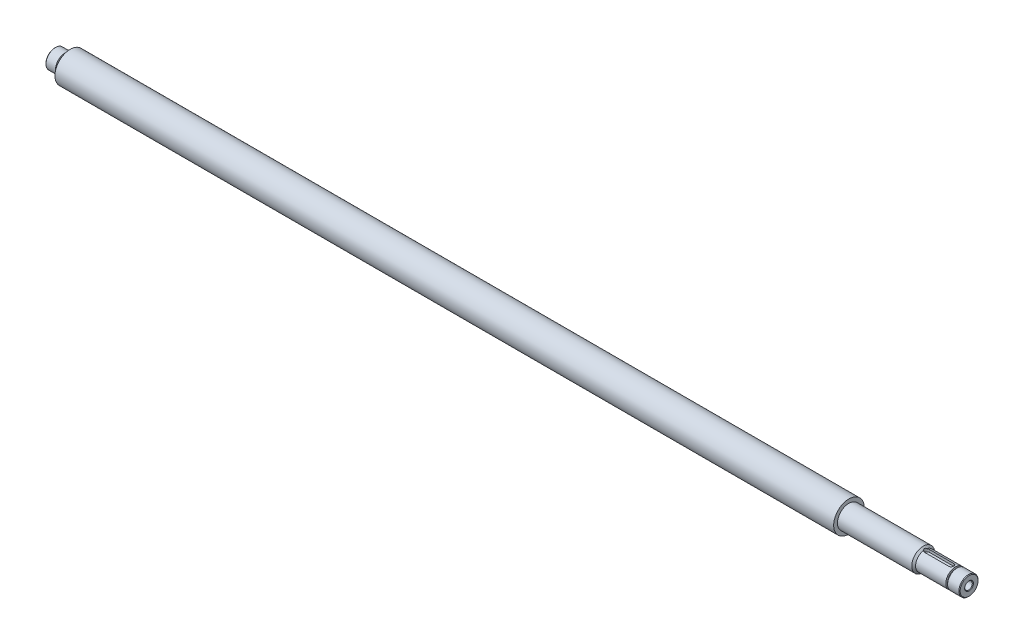
ISO-10303-21;
HEADER;
FILE_DESCRIPTION(('STEP AP214'),'2;1');
FILE_NAME('part.step','',(''),(''),'','','');
FILE_SCHEMA(('AUTOMOTIVE_DESIGN { 1 0 10303 214 1 1 1 1 }'));
ENDSEC;
DATA;
#1=APPLICATION_CONTEXT('core data for automotive mechanical design processes');
#2=APPLICATION_PROTOCOL_DEFINITION('international standard','automotive_design',2000,#1);
#3=PRODUCT_CONTEXT('',#1,'mechanical');
#4=PRODUCT('Part','Part','',(#3));
#5=PRODUCT_RELATED_PRODUCT_CATEGORY('part','',(#4));
#6=PRODUCT_DEFINITION_FORMATION('','',#4);
#7=PRODUCT_DEFINITION_CONTEXT('part definition',#1,'design');
#8=PRODUCT_DEFINITION('design','',#6,#7);
#9=PRODUCT_DEFINITION_SHAPE('','',#8);
#10=(LENGTH_UNIT() NAMED_UNIT(*) SI_UNIT(.MILLI.,.METRE.));
#11=(NAMED_UNIT(*) PLANE_ANGLE_UNIT() SI_UNIT($,.RADIAN.));
#12=(NAMED_UNIT(*) SI_UNIT($,.STERADIAN.) SOLID_ANGLE_UNIT());
#13=UNCERTAINTY_MEASURE_WITH_UNIT(LENGTH_MEASURE(1.E-05),#10,'distance_accuracy_value','');
#14=(GEOMETRIC_REPRESENTATION_CONTEXT(3) GLOBAL_UNCERTAINTY_ASSIGNED_CONTEXT((#13)) GLOBAL_UNIT_ASSIGNED_CONTEXT((#10,
#11,#12)) REPRESENTATION_CONTEXT('',''));
#15=CARTESIAN_POINT('',(0.,0.,0.));
#16=DIRECTION('',(0.,0.,1.));
#17=DIRECTION('',(1.,0.,0.));
#18=AXIS2_PLACEMENT_3D('',#15,#16,#17);
#19=CARTESIAN_POINT('',(364.29314999998,0.,0.));
#20=DIRECTION('',(1.,0.,0.));
#21=DIRECTION('',(0.,0.,-1.));
#22=AXIS2_PLACEMENT_3D('',#19,#20,#21);
#23=PLANE('',#22);
#24=CARTESIAN_POINT('',(364.29314999998,0.,0.));
#25=DIRECTION('',(1.,0.,0.));
#26=DIRECTION('',(0.,0.,-1.));
#27=AXIS2_PLACEMENT_3D('',#24,#25,#26);
#28=CIRCLE('',#27,1.5875);
#29=CARTESIAN_POINT('',(364.29314999998,0.,-1.5875));
#30=VERTEX_POINT('',#29);
#31=EDGE_CURVE('E19',#30,#30,#28,.T.);
#32=ORIENTED_EDGE('',*,*,#31,.T.);
#33=EDGE_LOOP('',(#32));
#34=FACE_BOUND('',#33,.T.);
#35=ADVANCED_FACE('F16',(#34),#23,.T.);
#36=CARTESIAN_POINT('',(364.29314999998,0.,0.));
#37=DIRECTION('',(1.,0.,0.));
#38=DIRECTION('',(0.,0.,-1.));
#39=AXIS2_PLACEMENT_3D('',#36,#37,#38);
#40=CYLINDRICAL_SURFACE('',#39,1.5875);
#41=ORIENTED_EDGE('',*,*,#31,.F.);
#42=EDGE_LOOP('',(#41));
#43=FACE_BOUND('',#42,.T.);
#44=CARTESIAN_POINT('',(383.089149999989,0.,0.));
#45=DIRECTION('',(1.,0.,0.));
#46=DIRECTION('',(0.,0.,-1.));
#47=AXIS2_PLACEMENT_3D('',#44,#45,#46);
#48=CIRCLE('',#47,1.58750000002783);
#49=CARTESIAN_POINT('',(383.089149999989,0.,-1.58750000002783));
#50=VERTEX_POINT('',#49);
#51=EDGE_CURVE('E108',#50,#50,#48,.T.);
#52=ORIENTED_EDGE('',*,*,#51,.T.);
#53=EDGE_LOOP('',(#52));
#54=FACE_BOUND('',#53,.T.);
#55=ADVANCED_FACE('F196',(#43,#54),#40,.F.);
#56=CARTESIAN_POINT('',(383.343149999916,0.,0.));
#57=DIRECTION('',(1.,0.,0.));
#58=DIRECTION('',(0.,1.,0.));
#59=AXIS2_PLACEMENT_3D('',#56,#57,#58);
#60=CONICAL_SURFACE('',#59,1.84149999989813,0.785398163397448);
#61=ORIENTED_EDGE('',*,*,#51,.F.);
#62=EDGE_LOOP('',(#61));
#63=FACE_BOUND('',#62,.T.);
#64=CARTESIAN_POINT('',(383.343149999973,0.,0.));
#65=DIRECTION('',(1.,0.,0.));
#66=DIRECTION('',(0.,1.,0.));
#67=AXIS2_PLACEMENT_3D('',#64,#65,#66);
#68=CIRCLE('',#67,1.84149999995498);
#69=CARTESIAN_POINT('',(383.343149999973,1.84149999995498,0.));
#70=VERTEX_POINT('',#69);
#71=EDGE_CURVE('E110',#70,#70,#68,.F.);
#72=ORIENTED_EDGE('',*,*,#71,.F.);
#73=EDGE_LOOP('',(#72));
#74=FACE_BOUND('',#73,.T.);
#75=ADVANCED_FACE('F193',(#63,#74),#60,.F.);
#76=CARTESIAN_POINT('',(383.34314999998,0.,0.));
#77=DIRECTION('',(1.,0.,0.));
#78=DIRECTION('',(0.,0.,-1.));
#79=AXIS2_PLACEMENT_3D('',#76,#77,#78);
#80=PLANE('',#79);
#81=CARTESIAN_POINT('',(383.343149999973,0.,0.));
#82=DIRECTION('',(-1.,0.,0.));
#83=DIRECTION('',(0.,0.,1.));
#84=AXIS2_PLACEMENT_3D('',#81,#82,#83);
#85=CIRCLE('',#84,3.71474999991506);
#86=CARTESIAN_POINT('',(383.343149999973,0.,3.71474999991506));
#87=VERTEX_POINT('',#86);
#88=EDGE_CURVE('E107',#87,#87,#85,.T.);
#89=ORIENTED_EDGE('',*,*,#88,.F.);
#90=EDGE_LOOP('',(#89));
#91=FACE_BOUND('',#90,.T.);
#92=ORIENTED_EDGE('',*,*,#71,.T.);
#93=EDGE_LOOP('',(#92));
#94=FACE_BOUND('',#93,.T.);
#95=ADVANCED_FACE('F189',(#91,#94),#80,.T.);
#96=CARTESIAN_POINT('',(383.089149999989,0.,0.));
#97=DIRECTION('',(-1.,0.,0.));
#98=DIRECTION('',(0.,0.,1.));
#99=AXIS2_PLACEMENT_3D('',#96,#97,#98);
#100=CONICAL_SURFACE('',#99,3.96874999989905,0.785398163397448);
#101=ORIENTED_EDGE('',*,*,#88,.T.);
#102=EDGE_LOOP('',(#101));
#103=FACE_BOUND('',#102,.T.);
#104=CARTESIAN_POINT('',(383.08914999998,0.,0.));
#105=DIRECTION('',(-1.,0.,0.));
#106=DIRECTION('',(0.,0.,1.));
#107=AXIS2_PLACEMENT_3D('',#104,#105,#106);
#108=CIRCLE('',#107,3.96875);
#109=CARTESIAN_POINT('',(383.08914999998,0.,3.96875));
#110=VERTEX_POINT('',#109);
#111=EDGE_CURVE('E103',#110,#110,#108,.T.);
#112=ORIENTED_EDGE('',*,*,#111,.F.);
#113=EDGE_LOOP('',(#112));
#114=FACE_BOUND('',#113,.T.);
#115=ADVANCED_FACE('F185',(#103,#114),#100,.T.);
#116=CARTESIAN_POINT('',(3.175,0.,0.));
#117=DIRECTION('',(-1.,0.,0.));
#118=DIRECTION('',(0.,0.,1.));
#119=AXIS2_PLACEMENT_3D('',#116,#117,#118);
#120=PLANE('',#119);
#121=CARTESIAN_POINT('',(3.17500000005566,0.,0.));
#122=DIRECTION('',(1.,0.,0.));
#123=DIRECTION('',(0.,0.,-1.));
#124=AXIS2_PLACEMENT_3D('',#121,#122,#123);
#125=CIRCLE('',#124,3.7147499999719);
#126=CARTESIAN_POINT('',(3.17500000005566,0.,-3.7147499999719));
#127=VERTEX_POINT('',#126);
#128=EDGE_CURVE('E106',#127,#127,#125,.T.);
#129=ORIENTED_EDGE('',*,*,#128,.F.);
#130=EDGE_LOOP('',(#129));
#131=FACE_BOUND('',#130,.T.);
#132=ADVANCED_FACE('F181',(#131),#120,.T.);
#133=CARTESIAN_POINT('',(383.34314999998,0.,0.));
#134=DIRECTION('',(-1.,0.,0.));
#135=DIRECTION('',(0.,0.,1.));
#136=AXIS2_PLACEMENT_3D('',#133,#134,#135);
#137=CYLINDRICAL_SURFACE('',#136,3.96875);
#138=ORIENTED_EDGE('',*,*,#111,.T.);
#139=EDGE_LOOP('',(#138));
#140=FACE_BOUND('',#139,.T.);
#141=CARTESIAN_POINT('',(378.36474999998,0.,0.));
#142=DIRECTION('',(-1.,0.,0.));
#143=DIRECTION('',(0.,0.,1.));
#144=AXIS2_PLACEMENT_3D('',#141,#142,#143);
#145=CIRCLE('',#144,3.96875);
#146=CARTESIAN_POINT('',(378.36474999998,0.,3.96875));
#147=VERTEX_POINT('',#146);
#148=EDGE_CURVE('E77',#147,#147,#145,.T.);
#149=ORIENTED_EDGE('',*,*,#148,.F.);
#150=EDGE_LOOP('',(#149));
#151=FACE_BOUND('',#150,.T.);
#152=ADVANCED_FACE('F177',(#140,#151),#137,.T.);
#153=CARTESIAN_POINT('',(3.42899999992596,0.,0.));
#154=DIRECTION('',(1.,0.,0.));
#155=DIRECTION('',(0.,0.,-1.));
#156=AXIS2_PLACEMENT_3D('',#153,#154,#155);
#157=CONICAL_SURFACE('',#156,3.96874999989905,0.785398163509345);
#158=ORIENTED_EDGE('',*,*,#128,.T.);
#159=EDGE_LOOP('',(#158));
#160=FACE_BOUND('',#159,.T.);
#161=CARTESIAN_POINT('',(3.42900000000003,0.,0.));
#162=DIRECTION('',(1.,0.,0.));
#163=DIRECTION('',(0.,0.,-1.));
#164=AXIS2_PLACEMENT_3D('',#161,#162,#163);
#165=CIRCLE('',#164,3.96875);
#166=CARTESIAN_POINT('',(3.42900000000003,0.,-3.96875));
#167=VERTEX_POINT('',#166);
#168=EDGE_CURVE('E99',#167,#167,#165,.T.);
#169=ORIENTED_EDGE('',*,*,#168,.F.);
#170=EDGE_LOOP('',(#169));
#171=FACE_BOUND('',#170,.T.);
#172=ADVANCED_FACE('F173',(#160,#171),#157,.T.);
#173=CARTESIAN_POINT('',(378.36474999998,0.,-22.225));
#174=DIRECTION('',(-1.,0.,0.));
#175=DIRECTION('',(0.,0.,1.));
#176=AXIS2_PLACEMENT_3D('',#173,#174,#175);
#177=PLANE('',#176);
#178=ORIENTED_EDGE('',*,*,#148,.T.);
#179=EDGE_LOOP('',(#178));
#180=FACE_BOUND('',#179,.T.);
#181=CARTESIAN_POINT('',(378.36474999998,0.,0.));
#182=DIRECTION('',(1.,0.,0.));
#183=DIRECTION('',(0.,0.,-1.));
#184=AXIS2_PLACEMENT_3D('',#181,#182,#183);
#185=CIRCLE('',#184,3.175);
#186=CARTESIAN_POINT('',(378.36474999998,0.,-3.175));
#187=VERTEX_POINT('',#186);
#188=EDGE_CURVE('E102',#187,#187,#185,.F.);
#189=ORIENTED_EDGE('',*,*,#188,.F.);
#190=EDGE_LOOP('',(#189));
#191=FACE_BOUND('',#190,.T.);
#192=ADVANCED_FACE('F167',(#180,#191),#177,.T.);
#193=CARTESIAN_POINT('',(365.81714999998,5.30554999999999,0.));
#194=DIRECTION('',(0.,-1.,0.));
#195=DIRECTION('',(0.,0.,-1.));
#196=AXIS2_PLACEMENT_3D('',#193,#194,#195);
#197=CYLINDRICAL_SURFACE('',#196,1.016);
#198=CARTESIAN_POINT('',(365.81714999998,3.83649847680146,1.01600000000003));
#199=CARTESIAN_POINT('',(365.789074339526,3.83649655807795,1.01600024098621));
#200=CARTESIAN_POINT('',(365.7610128192,3.83680706636788,1.01483546195629));
#201=CARTESIAN_POINT('',(365.705099410303,3.83803295663375,1.01019216098555));
#202=CARTESIAN_POINT('',(365.677247490381,3.83894824625515,1.00671399231573));
#203=CARTESIAN_POINT('',(365.594402662799,3.84256546981599,0.992856299490583));
#204=CARTESIAN_POINT('',(365.539979413233,3.84613895420594,0.979053401170294));
#205=CARTESIAN_POINT('',(365.434316289364,3.85519131533632,0.942773419508419));
#206=CARTESIAN_POINT('',(365.383076692287,3.86067035773495,0.920295581999039));
#207=CARTESIAN_POINT('',(365.285096296162,3.87291119616642,0.867334861884763));
#208=CARTESIAN_POINT('',(365.238352927547,3.87967225289173,0.836856589068619));
#209=CARTESIAN_POINT('',(365.169226267174,3.89074557233872,0.783245948925418));
#210=CARTESIAN_POINT('',(365.14492969341,3.89487805845011,0.76249275990274));
#211=CARTESIAN_POINT('',(365.09843710947,3.9031715311668,0.718833958468433));
#212=CARTESIAN_POINT('',(365.076237660529,3.9073324586808,0.695931996926632));
#213=CARTESIAN_POINT('',(365.055149999974,3.91144021589343,0.672020833004098));
#214=B_SPLINE_CURVE_WITH_KNOTS('',3,(#198,#199,#200,#201,#202,#203,#204,#205,#206,#207,#208,
#209,#210,#211,#212,#213),.UNSPECIFIED.,.F.,.F.,(4,2,2,2,2,2,2,4),(0.,0.084173300717206,
0.168333750525152,0.336236358766278,0.50415356714138,0.67197423449429,0.768506844657109,
0.864878312959558),.UNSPECIFIED.);
#215=CARTESIAN_POINT('',(365.81714999998,3.83649847680146,1.01600000000003));
#216=VERTEX_POINT('',#215);
#217=CARTESIAN_POINT('',(365.055149999982,3.91144021584078,0.672020833012472));
#218=VERTEX_POINT('',#217);
#219=EDGE_CURVE('E95',#216,#218,#214,.T.);
#220=ORIENTED_EDGE('',*,*,#219,.F.);
#221=DIRECTION('',(0.,-1.,0.));
#222=VECTOR('',#221,1.);
#223=CARTESIAN_POINT('',(365.81714999998,5.30554999999999,1.01600000000003));
#224=LINE('',#223,#222);
#225=CARTESIAN_POINT('',(365.81714999998,2.81634999999999,1.01600000000003));
#226=VERTEX_POINT('',#225);
#227=EDGE_CURVE('E93',#226,#216,#224,.F.);
#228=ORIENTED_EDGE('',*,*,#227,.F.);
#229=CARTESIAN_POINT('',(365.81714999998,2.81634999999999,0.));
#230=DIRECTION('',(0.,-1.,0.));
#231=DIRECTION('',(0.,0.,-1.));
#232=AXIS2_PLACEMENT_3D('',#229,#230,#231);
#233=CIRCLE('',#232,1.016);
#234=CARTESIAN_POINT('',(365.81714999998,2.81634999999999,-1.01599999999997));
#235=VERTEX_POINT('',#234);
#236=EDGE_CURVE('E91',#226,#235,#233,.T.);
#237=ORIENTED_EDGE('',*,*,#236,.T.);
#238=DIRECTION('',(0.,-1.,0.));
#239=VECTOR('',#238,1.);
#240=CARTESIAN_POINT('',(365.81714999998,5.30554999999999,-1.01599999999997));
#241=LINE('',#240,#239);
#242=CARTESIAN_POINT('',(365.81714999998,3.83649847680148,-1.01599999999997));
#243=VERTEX_POINT('',#242);
#244=EDGE_CURVE('E76',#243,#235,#241,.T.);
#245=ORIENTED_EDGE('',*,*,#244,.F.);
#246=CARTESIAN_POINT('',(365.05514999998,3.91144021589234,-0.672020833010454));
#247=CARTESIAN_POINT('',(365.092863201918,3.90408226838989,-0.714842817990914));
#248=CARTESIAN_POINT('',(365.134224918746,3.89655779756544,-0.754419427857203));
#249=CARTESIAN_POINT('',(365.223086497352,3.88197562196348,-0.826189348854452));
#250=CARTESIAN_POINT('',(365.270594355154,3.87491854366297,-0.858372887617566));
#251=CARTESIAN_POINT('',(365.37054734497,3.86208640953377,-0.914382203674269));
#252=CARTESIAN_POINT('',(365.422998681667,3.85631299621681,-0.938197295479835));
#253=CARTESIAN_POINT('',(365.531257868991,3.8467604993438,-0.976630360325471));
#254=CARTESIAN_POINT('',(365.587058548847,3.84297731334557,-0.991267264360344));
#255=CARTESIAN_POINT('',(365.672317957102,3.83912394272326,-1.00604532812612));
#256=CARTESIAN_POINT('',(365.701156173613,3.83814278398676,-1.0097754687014));
#257=CARTESIAN_POINT('',(365.75904132168,3.8368291335745,-1.01475220932442));
#258=CARTESIAN_POINT('',(365.78808810149,3.83649621045302,-1.01600046125276));
#259=CARTESIAN_POINT('',(365.81714999998,3.83649847680148,-1.01599999999997));
#260=B_SPLINE_CURVE_WITH_KNOTS('',3,(#246,#247,#248,#249,#250,#251,#252,#253,#254,#255,#256,
#257,#258,#259),.UNSPECIFIED.,.F.,.F.,(4,2,2,2,2,2,4),(0.,0.17240455398,0.345035702357616,
0.517886485481197,0.690379562391287,0.777564930764776,0.86469225137165),.UNSPECIFIED.);
#261=CARTESIAN_POINT('',(365.055149999968,3.91144021578482,-0.672020832996854));
#262=VERTEX_POINT('',#261);
#263=EDGE_CURVE('E66',#262,#243,#260,.T.);
#264=ORIENTED_EDGE('',*,*,#263,.F.);
#265=CARTESIAN_POINT('',(365.055149999937,3.91144021579326,0.672020832961947));
#266=CARTESIAN_POINT('',(365.026045649241,3.94663707757243,0.638985000088227));
#267=CARTESIAN_POINT('',(364.99813445496,3.98057362417654,0.603031915369367));
#268=CARTESIAN_POINT('',(364.945782346284,4.04446808087447,0.52463353926634));
#269=CARTESIAN_POINT('',(364.921387328837,4.07437308912116,0.482115200203082));
#270=CARTESIAN_POINT('',(364.88324642174,4.12126181441779,0.401911695213403));
#271=CARTESIAN_POINT('',(364.868355806798,4.13961619956198,0.365594566361844));
#272=CARTESIAN_POINT('',(364.842514459879,4.17151821849332,0.289723753061901));
#273=CARTESIAN_POINT('',(364.831548734036,4.18508414235761,0.25018310998333));
#274=CARTESIAN_POINT('',(364.814258213123,4.20649305464903,0.168050687431386));
#275=CARTESIAN_POINT('',(364.807988168618,4.21426852199973,0.125429079943492));
#276=CARTESIAN_POINT('',(364.800977206253,4.22296361722546,0.0390204895654291));
#277=CARTESIAN_POINT('',(364.800234806667,4.22388508236565,-0.00476617786333961));
#278=CARTESIAN_POINT('',(364.804035806214,4.21917025653282,-0.0849404597698114));
#279=CARTESIAN_POINT('',(364.807784476603,4.21451992539556,-0.121431098087903));
#280=CARTESIAN_POINT('',(364.818977695527,4.20064865423194,-0.192918818065849));
#281=CARTESIAN_POINT('',(364.826421938455,4.19142809214245,-0.227916022965843));
#282=CARTESIAN_POINT('',(364.847034893171,4.16593408534218,-0.305201192198014));
#283=CARTESIAN_POINT('',(364.861220946354,4.14841101056433,-0.346801535770036));
#284=CARTESIAN_POINT('',(364.893725643349,4.10836577713652,-0.425891694219275));
#285=CARTESIAN_POINT('',(364.912060244422,4.08582432097091,-0.463364783610832));
#286=CARTESIAN_POINT('',(364.950316407108,4.03894291029061,-0.53128121744061));
#287=CARTESIAN_POINT('',(364.97001172542,4.01486952292547,-0.562042296543696));
#288=CARTESIAN_POINT('',(365.011284433417,3.96459674581604,-0.619737119716292));
#289=CARTESIAN_POINT('',(365.032841403113,3.9384205992902,-0.646705536926426));
#290=CARTESIAN_POINT('',(365.055149999947,3.9114402157815,-0.672020832972935));
#291=B_SPLINE_CURVE_WITH_KNOTS('',3,(#265,#266,#267,#268,#269,#270,#271,#272,#273,#274,#275,
#276,#277,#278,#279,#280,#281,#282,#283,#284,#285,#286,#287,#288,#289,#290),.UNSPECIFIED.,.F.,
.F.,(4,2,2,2,2,2,2,2,2,2,2,2,4),(0.,0.169491291431036,0.34102606970601,0.470534814534422,
0.59954339215234,0.730033713382287,0.860489054471362,0.970897544435752,1.08129690565363,
1.22247535003477,1.364206353615,1.49517443421655,1.62485417002255),.UNSPECIFIED.);
#292=EDGE_CURVE('E60',#218,#262,#291,.T.);
#293=ORIENTED_EDGE('',*,*,#292,.F.);
#294=EDGE_LOOP('',(#220,#228,#237,#245,#264,#293));
#295=FACE_BOUND('',#294,.T.);
#296=ADVANCED_FACE('F89',(#295),#197,.F.);
#297=CARTESIAN_POINT('',(3.175,0.,0.));
#298=DIRECTION('',(1.,0.,0.));
#299=DIRECTION('',(0.,0.,-1.));
#300=AXIS2_PLACEMENT_3D('',#297,#298,#299);
#301=CYLINDRICAL_SURFACE('',#300,3.96875);
#302=ORIENTED_EDGE('',*,*,#168,.T.);
#303=EDGE_LOOP('',(#302));
#304=FACE_BOUND('',#303,.T.);
#305=CARTESIAN_POINT('',(7.39140000000003,0.,0.));
#306=DIRECTION('',(1.,0.,0.));
#307=DIRECTION('',(0.,0.,-1.));
#308=AXIS2_PLACEMENT_3D('',#305,#306,#307);
#309=CIRCLE('',#308,3.96875);
#310=CARTESIAN_POINT('',(7.39140000000003,0.,-3.96875));
#311=VERTEX_POINT('',#310);
#312=EDGE_CURVE('E258',#311,#311,#309,.T.);
#313=ORIENTED_EDGE('',*,*,#312,.F.);
#314=EDGE_LOOP('',(#313));
#315=FACE_BOUND('',#314,.T.);
#316=ADVANCED_FACE('F166',(#304,#315),#301,.T.);
#317=CARTESIAN_POINT('',(364.2614,0.,0.));
#318=DIRECTION('',(1.,0.,0.));
#319=DIRECTION('',(0.,0.,-1.));
#320=AXIS2_PLACEMENT_3D('',#317,#318,#319);
#321=CYLINDRICAL_SURFACE('',#320,3.175);
#322=CARTESIAN_POINT('',(377.62814999998,0.,0.));
#323=DIRECTION('',(1.,0.,0.));
#324=DIRECTION('',(0.,0.,-1.));
#325=AXIS2_PLACEMENT_3D('',#322,#323,#324);
#326=CIRCLE('',#325,3.175);
#327=CARTESIAN_POINT('',(377.62814999998,0.,-3.175));
#328=VERTEX_POINT('',#327);
#329=EDGE_CURVE('E254',#328,#328,#326,.F.);
#330=ORIENTED_EDGE('',*,*,#329,.F.);
#331=EDGE_LOOP('',(#330));
#332=FACE_BOUND('',#331,.T.);
#333=ORIENTED_EDGE('',*,*,#188,.T.);
#334=EDGE_LOOP('',(#333));
#335=FACE_BOUND('',#334,.T.);
#336=ADVANCED_FACE('F268',(#332,#335),#321,.T.);
#337=CARTESIAN_POINT('',(365.81714999998,2.81634999999999,0.));
#338=DIRECTION('',(0.,-1.,0.));
#339=DIRECTION('',(0.,0.,-1.));
#340=AXIS2_PLACEMENT_3D('',#337,#338,#339);
#341=PLANE('',#340);
#342=DIRECTION('',(1.,0.,0.));
#343=VECTOR('',#342,1.);
#344=CARTESIAN_POINT('',(365.81714999998,2.81634999999999,1.01600000000003));
#345=LINE('',#344,#343);
#346=CARTESIAN_POINT('',(375.97714999998,2.81634999999999,1.01600000000003));
#347=VERTEX_POINT('',#346);
#348=EDGE_CURVE('E250',#226,#347,#345,.T.);
#349=ORIENTED_EDGE('',*,*,#348,.T.);
#350=CARTESIAN_POINT('',(375.97714999998,2.81634999999999,0.));
#351=DIRECTION('',(0.,-1.,0.));
#352=DIRECTION('',(0.,0.,-1.));
#353=AXIS2_PLACEMENT_3D('',#350,#351,#352);
#354=CIRCLE('',#353,1.016);
#355=CARTESIAN_POINT('',(375.97714999998,2.81634999999999,-1.01599999999997));
#356=VERTEX_POINT('',#355);
#357=EDGE_CURVE('E252',#347,#356,#354,.F.);
#358=ORIENTED_EDGE('',*,*,#357,.T.);
#359=DIRECTION('',(-1.,0.,0.));
#360=VECTOR('',#359,1.);
#361=CARTESIAN_POINT('',(365.81714999998,2.81634999999999,-1.01599999999997));
#362=LINE('',#361,#360);
#363=EDGE_CURVE('E253',#356,#235,#362,.T.);
#364=ORIENTED_EDGE('',*,*,#363,.T.);
#365=ORIENTED_EDGE('',*,*,#236,.F.);
#366=EDGE_LOOP('',(#349,#358,#364,#365));
#367=FACE_BOUND('',#366,.T.);
#368=ADVANCED_FACE('F271',(#367),#341,.F.);
#369=CARTESIAN_POINT('',(7.39140000000003,0.,-22.225));
#370=DIRECTION('',(1.,0.,0.));
#371=DIRECTION('',(0.,0.,-1.));
#372=AXIS2_PLACEMENT_3D('',#369,#370,#371);
#373=PLANE('',#372);
#374=ORIENTED_EDGE('',*,*,#312,.T.);
#375=EDGE_LOOP('',(#374));
#376=FACE_BOUND('',#375,.T.);
#377=CARTESIAN_POINT('',(7.39140000000005,0.,0.));
#378=DIRECTION('',(1.,0.,0.));
#379=DIRECTION('',(0.,0.,-1.));
#380=AXIS2_PLACEMENT_3D('',#377,#378,#379);
#381=CIRCLE('',#380,3.17500000000005);
#382=CARTESIAN_POINT('',(7.39140000000005,0.,-3.17500000000005));
#383=VERTEX_POINT('',#382);
#384=EDGE_CURVE('E249',#383,#383,#381,.T.);
#385=ORIENTED_EDGE('',*,*,#384,.F.);
#386=EDGE_LOOP('',(#385));
#387=FACE_BOUND('',#386,.T.);
#388=ADVANCED_FACE('F277',(#376,#387),#373,.T.);
#389=CARTESIAN_POINT('',(377.62814999998,0.,-22.225));
#390=DIRECTION('',(1.,0.,0.));
#391=DIRECTION('',(0.,0.,-1.));
#392=AXIS2_PLACEMENT_3D('',#389,#390,#391);
#393=PLANE('',#392);
#394=CARTESIAN_POINT('',(377.62814999998,0.,0.));
#395=DIRECTION('',(-1.,0.,0.));
#396=DIRECTION('',(0.,0.,1.));
#397=AXIS2_PLACEMENT_3D('',#394,#395,#396);
#398=CIRCLE('',#397,3.96875);
#399=CARTESIAN_POINT('',(377.62814999998,0.,3.96875));
#400=VERTEX_POINT('',#399);
#401=EDGE_CURVE('E86',#400,#400,#398,.T.);
#402=ORIENTED_EDGE('',*,*,#401,.F.);
#403=EDGE_LOOP('',(#402));
#404=FACE_BOUND('',#403,.T.);
#405=ORIENTED_EDGE('',*,*,#329,.T.);
#406=EDGE_LOOP('',(#405));
#407=FACE_BOUND('',#406,.T.);
#408=ADVANCED_FACE('F283',(#404,#407),#393,.T.);
#409=CARTESIAN_POINT('',(365.81714999998,5.30554999999999,-1.01599999999997));
#410=DIRECTION('',(0.,0.,-1.));
#411=DIRECTION('',(-1.,0.,0.));
#412=AXIS2_PLACEMENT_3D('',#409,#410,#411);
#413=PLANE('',#412);
#414=ORIENTED_EDGE('',*,*,#363,.F.);
#415=DIRECTION('',(0.,-1.,0.));
#416=VECTOR('',#415,1.);
#417=CARTESIAN_POINT('',(375.97714999998,5.30554999999999,-1.01599999999997));
#418=LINE('',#417,#416);
#419=CARTESIAN_POINT('',(375.97714999998,3.83649847680148,-1.01599999999997));
#420=VERTEX_POINT('',#419);
#421=EDGE_CURVE('E84',#356,#420,#418,.F.);
#422=ORIENTED_EDGE('',*,*,#421,.T.);
#423=DIRECTION('',(-1.,0.,0.));
#424=VECTOR('',#423,1.);
#425=CARTESIAN_POINT('',(383.34314999998,3.83649847680148,-1.01599999999998));
#426=LINE('',#425,#424);
#427=EDGE_CURVE('E72',#243,#420,#426,.F.);
#428=ORIENTED_EDGE('',*,*,#427,.F.);
#429=ORIENTED_EDGE('',*,*,#244,.T.);
#430=EDGE_LOOP('',(#414,#422,#428,#429));
#431=FACE_BOUND('',#430,.T.);
#432=ADVANCED_FACE('F81',(#431),#413,.F.);
#433=CARTESIAN_POINT('',(375.97714999998,5.30554999999999,0.));
#434=DIRECTION('',(0.,-1.,0.));
#435=DIRECTION('',(0.,0.,-1.));
#436=AXIS2_PLACEMENT_3D('',#433,#434,#435);
#437=CYLINDRICAL_SURFACE('',#436,1.016);
#438=ORIENTED_EDGE('',*,*,#357,.F.);
#439=DIRECTION('',(0.,1.,0.));
#440=VECTOR('',#439,1.);
#441=CARTESIAN_POINT('',(375.97714999998,5.30554999999999,1.01600000000003));
#442=LINE('',#441,#440);
#443=CARTESIAN_POINT('',(375.97714999998,3.83649847680146,1.01600000000003));
#444=VERTEX_POINT('',#443);
#445=EDGE_CURVE('E34',#347,#444,#442,.T.);
#446=ORIENTED_EDGE('',*,*,#445,.T.);
#447=CARTESIAN_POINT('',(375.97714999998,3.83649847680148,-1.01599999999997));
#448=CARTESIAN_POINT('',(376.005232117698,3.8364965307861,-1.01600036882975));
#449=CARTESIAN_POINT('',(376.03330029599,3.83680719885179,-1.0148349780035));
#450=CARTESIAN_POINT('',(376.089226268173,3.83803367436216,-1.01018942257077));
#451=CARTESIAN_POINT('',(376.117084097897,3.83894937627158,-1.00670966165613));
#452=CARTESIAN_POINT('',(376.199921518973,3.8425670200339,-0.992850358077406));
#453=CARTESIAN_POINT('',(376.254331119969,3.84613973249548,-0.979050564349116));
#454=CARTESIAN_POINT('',(376.359962146837,3.85518959202628,-0.942780043809727));
#455=CARTESIAN_POINT('',(376.411183960423,3.86066650696061,-0.920310373877343));
#456=CARTESIAN_POINT('',(376.509157970993,3.87290441870489,-0.867366047154576));
#457=CARTESIAN_POINT('',(376.555908865854,3.87966578790086,-0.836889067919602));
#458=CARTESIAN_POINT('',(376.644660726039,3.89388354188958,-0.76805250279463));
#459=CARTESIAN_POINT('',(376.686543604242,3.90135139962633,-0.729543072267722));
#460=CARTESIAN_POINT('',(376.763335608172,3.91604199140291,-0.646053823404773));
#461=CARTESIAN_POINT('',(376.798243613297,3.92326468589965,-0.601072967345447));
#462=CARTESIAN_POINT('',(376.860580248618,3.93677879775893,-0.50510200654503));
#463=CARTESIAN_POINT('',(376.88789163842,3.94305499816506,-0.454033423400695));
#464=CARTESIAN_POINT('',(376.933495722822,3.95383663506577,-0.347844862832095));
#465=CARTESIAN_POINT('',(376.951790252562,3.95834243184069,-0.292725712418508));
#466=CARTESIAN_POINT('',(376.978461233202,3.96499439613665,-0.181237611453934));
#467=CARTESIAN_POINT('',(376.987039572087,3.9671885264225,-0.124919869410297));
#468=CARTESIAN_POINT('',(376.994668963786,3.96913729991417,-0.0116034940671553));
#469=CARTESIAN_POINT('',(376.99372128116,3.96889226691424,0.0453950478541406));
#470=CARTESIAN_POINT('',(376.982469291487,3.96602573182547,0.157050518952893));
#471=CARTESIAN_POINT('',(376.972383179651,3.9634596510183,0.211731074693986));
#472=CARTESIAN_POINT('',(376.943492100012,3.95630422351476,0.318595637923097));
#473=CARTESIAN_POINT('',(376.9246867361,3.95171478489952,0.37077953187116));
#474=CARTESIAN_POINT('',(376.878717503722,3.94094438262645,0.471739184881145));
#475=CARTESIAN_POINT('',(376.851476902399,3.93474889714661,0.520478392673244));
#476=CARTESIAN_POINT('',(376.789469375868,3.92143706805957,0.612768417256418));
#477=CARTESIAN_POINT('',(376.754701251652,3.91432057782425,0.656318405775385));
#478=CARTESIAN_POINT('',(376.677464717508,3.89970329674694,0.738292158129691));
#479=CARTESIAN_POINT('',(376.634806538737,3.89219732876389,0.776536373111752));
#480=CARTESIAN_POINT('',(376.543591617661,3.87782831789178,0.845378453000194));
#481=CARTESIAN_POINT('',(376.495033261568,3.87096545181421,0.875974218910324));
#482=CARTESIAN_POINT('',(376.393023080127,3.8586388773889,0.928775964053226));
#483=CARTESIAN_POINT('',(376.339544393242,3.8531835536007,0.950932025157885));
#484=CARTESIAN_POINT('',(376.229478708631,3.84439831971569,0.985853852591684));
#485=CARTESIAN_POINT('',(376.17289650192,3.84106522846847,0.998633677961683));
#486=CARTESIAN_POINT('',(376.092708062573,3.83816902624918,1.00967440468688));
#487=CARTESIAN_POINT('',(376.069645740232,3.8375435800947,1.01204684611684));
#488=CARTESIAN_POINT('',(376.023442626753,3.83670846641588,1.01520789726257));
#489=CARTESIAN_POINT('',(376.000302021728,3.83649813111499,1.01599905077559));
#490=CARTESIAN_POINT('',(375.97714999998,3.83649847680146,1.01600000000003));
#491=B_SPLINE_CURVE_WITH_KNOTS('',3,(#447,#448,#449,#450,#451,#452,#453,#454,#455,#456,#457,
#458,#459,#460,#461,#462,#463,#464,#465,#466,#467,#468,#469,#470,#471,#472,#473,#474,#475,#476,
#477,#478,#479,#480,#481,#482,#483,#484,#485,#486,#487,#488,#489,#490),.UNSPECIFIED.,.F.,.F.,(4,
2,2,2,2,2,2,2,2,2,2,2,2,2,2,2,2,2,2,2,2,4),(0.,0.0841930560916811,0.16837143037474,
0.336236459648141,0.504081032233321,0.671974340399637,0.843336289917674,1.01472574881463,
1.18862960092247,1.36249804493094,1.53268338742047,1.7028461384339,1.8690500457987,
2.03526150439915,2.20303170807668,2.37082865446001,2.54336536457755,2.71594937282154,
2.88953887011914,3.06286754658296,3.13239841206051,3.20181733382417),.UNSPECIFIED.);
#492=EDGE_CURVE('E85',#420,#444,#491,.T.);
#493=ORIENTED_EDGE('',*,*,#492,.F.);
#494=ORIENTED_EDGE('',*,*,#421,.F.);
#495=EDGE_LOOP('',(#438,#446,#493,#494));
#496=FACE_BOUND('',#495,.T.);
#497=ADVANCED_FACE('F135',(#496),#437,.F.);
#498=CARTESIAN_POINT('',(365.81714999998,5.30554999999999,1.01600000000003));
#499=DIRECTION('',(0.,0.,1.));
#500=DIRECTION('',(1.,0.,0.));
#501=AXIS2_PLACEMENT_3D('',#498,#499,#500);
#502=PLANE('',#501);
#503=ORIENTED_EDGE('',*,*,#348,.F.);
#504=ORIENTED_EDGE('',*,*,#227,.T.);
#505=DIRECTION('',(-1.,0.,0.));
#506=VECTOR('',#505,1.);
#507=CARTESIAN_POINT('',(383.34314999998,3.83649847680146,1.01600000000002));
#508=LINE('',#507,#506);
#509=EDGE_CURVE('E127',#444,#216,#508,.T.);
#510=ORIENTED_EDGE('',*,*,#509,.F.);
#511=ORIENTED_EDGE('',*,*,#445,.F.);
#512=EDGE_LOOP('',(#503,#504,#510,#511));
#513=FACE_BOUND('',#512,.T.);
#514=ADVANCED_FACE('F291',(#513),#502,.F.);
#515=CARTESIAN_POINT('',(364.2614,0.,0.));
#516=DIRECTION('',(1.,0.,0.));
#517=DIRECTION('',(0.,0.,-1.));
#518=AXIS2_PLACEMENT_3D('',#515,#516,#517);
#519=CYLINDRICAL_SURFACE('',#518,3.17500000000005);
#520=ORIENTED_EDGE('',*,*,#384,.T.);
#521=EDGE_LOOP('',(#520));
#522=FACE_BOUND('',#521,.T.);
#523=CARTESIAN_POINT('',(8.12800000000002,0.,0.));
#524=DIRECTION('',(1.,0.,0.));
#525=DIRECTION('',(0.,0.,-1.));
#526=AXIS2_PLACEMENT_3D('',#523,#524,#525);
#527=CIRCLE('',#526,3.17500000000005);
#528=CARTESIAN_POINT('',(8.12800000000002,0.,-3.17500000000005));
#529=VERTEX_POINT('',#528);
#530=EDGE_CURVE('E124',#529,#529,#527,.T.);
#531=ORIENTED_EDGE('',*,*,#530,.F.);
#532=EDGE_LOOP('',(#531));
#533=FACE_BOUND('',#532,.T.);
#534=ADVANCED_FACE('F144',(#522,#533),#519,.T.);
#535=CARTESIAN_POINT('',(383.34314999998,0.,0.));
#536=DIRECTION('',(-1.,0.,0.));
#537=DIRECTION('',(0.,0.,1.));
#538=AXIS2_PLACEMENT_3D('',#535,#536,#537);
#539=CYLINDRICAL_SURFACE('',#538,3.96875);
#540=ORIENTED_EDGE('',*,*,#219,.T.);
#541=CARTESIAN_POINT('',(365.055149999989,0.,0.));
#542=DIRECTION('',(-1.,0.,0.));
#543=DIRECTION('',(0.,0.,-1.));
#544=AXIS2_PLACEMENT_3D('',#541,#542,#543);
#545=CIRCLE('',#544,3.96874999989905);
#546=EDGE_CURVE('E73',#262,#218,#545,.T.);
#547=ORIENTED_EDGE('',*,*,#546,.F.);
#548=ORIENTED_EDGE('',*,*,#263,.T.);
#549=ORIENTED_EDGE('',*,*,#427,.T.);
#550=ORIENTED_EDGE('',*,*,#492,.T.);
#551=ORIENTED_EDGE('',*,*,#509,.T.);
#552=EDGE_LOOP('',(#540,#547,#548,#549,#550,#551));
#553=FACE_BOUND('',#552,.T.);
#554=ORIENTED_EDGE('',*,*,#401,.T.);
#555=EDGE_LOOP('',(#554));
#556=FACE_BOUND('',#555,.T.);
#557=ADVANCED_FACE('F69',(#553,#556),#539,.T.);
#558=CARTESIAN_POINT('',(8.128,0.,-22.225));
#559=DIRECTION('',(-1.,0.,0.));
#560=DIRECTION('',(0.,0.,1.));
#561=AXIS2_PLACEMENT_3D('',#558,#559,#560);
#562=PLANE('',#561);
#563=CARTESIAN_POINT('',(8.128,0.,0.));
#564=DIRECTION('',(1.,0.,0.));
#565=DIRECTION('',(0.,0.,-1.));
#566=AXIS2_PLACEMENT_3D('',#563,#564,#565);
#567=CIRCLE('',#566,3.96875);
#568=CARTESIAN_POINT('',(8.128,0.,-3.96875));
#569=VERTEX_POINT('',#568);
#570=EDGE_CURVE('E121',#569,#569,#567,.T.);
#571=ORIENTED_EDGE('',*,*,#570,.F.);
#572=EDGE_LOOP('',(#571));
#573=FACE_BOUND('',#572,.T.);
#574=ORIENTED_EDGE('',*,*,#530,.T.);
#575=EDGE_LOOP('',(#574));
#576=FACE_BOUND('',#575,.T.);
#577=ADVANCED_FACE('F143',(#573,#576),#562,.T.);
#578=CARTESIAN_POINT('',(364.261400000032,0.,0.));
#579=DIRECTION('',(-1.,0.,0.));
#580=DIRECTION('',(0.,0.,1.));
#581=AXIS2_PLACEMENT_3D('',#578,#579,#580);
#582=CONICAL_SURFACE('',#581,4.76249999985612,0.785398163433255);
#583=ORIENTED_EDGE('',*,*,#546,.T.);
#584=ORIENTED_EDGE('',*,*,#292,.T.);
#585=EDGE_LOOP('',(#583,#584));
#586=FACE_BOUND('',#585,.T.);
#587=CARTESIAN_POINT('',(364.2614,0.,0.));
#588=DIRECTION('',(-1.,0.,0.));
#589=DIRECTION('',(0.,0.,1.));
#590=AXIS2_PLACEMENT_3D('',#587,#588,#589);
#591=CIRCLE('',#590,4.7625);
#592=CARTESIAN_POINT('',(364.2614,0.,4.7625));
#593=VERTEX_POINT('',#592);
#594=EDGE_CURVE('E120',#593,#593,#591,.T.);
#595=ORIENTED_EDGE('',*,*,#594,.F.);
#596=EDGE_LOOP('',(#595));
#597=FACE_BOUND('',#596,.T.);
#598=ADVANCED_FACE('F229',(#586,#597),#582,.T.);
#599=CARTESIAN_POINT('',(3.175,0.,0.));
#600=DIRECTION('',(1.,0.,0.));
#601=DIRECTION('',(0.,0.,-1.));
#602=AXIS2_PLACEMENT_3D('',#599,#600,#601);
#603=CYLINDRICAL_SURFACE('',#602,3.96875);
#604=CARTESIAN_POINT('',(9.525,0.,0.));
#605=DIRECTION('',(1.,0.,0.));
#606=DIRECTION('',(0.,0.,-1.));
#607=AXIS2_PLACEMENT_3D('',#604,#605,#606);
#608=CIRCLE('',#607,3.96875);
#609=CARTESIAN_POINT('',(9.525,0.,-3.96875));
#610=VERTEX_POINT('',#609);
#611=EDGE_CURVE('E117',#610,#610,#608,.T.);
#612=ORIENTED_EDGE('',*,*,#611,.F.);
#613=EDGE_LOOP('',(#612));
#614=FACE_BOUND('',#613,.T.);
#615=ORIENTED_EDGE('',*,*,#570,.T.);
#616=EDGE_LOOP('',(#615));
#617=FACE_BOUND('',#616,.T.);
#618=ADVANCED_FACE('F226',(#614,#617),#603,.T.);
#619=CARTESIAN_POINT('',(364.2614,0.,0.));
#620=DIRECTION('',(-1.,0.,0.));
#621=DIRECTION('',(0.,0.,1.));
#622=AXIS2_PLACEMENT_3D('',#619,#620,#621);
#623=CYLINDRICAL_SURFACE('',#622,4.7625);
#624=CARTESIAN_POINT('',(333.375,0.,0.));
#625=DIRECTION('',(-1.,0.,0.));
#626=DIRECTION('',(0.,0.,1.));
#627=AXIS2_PLACEMENT_3D('',#624,#625,#626);
#628=CIRCLE('',#627,4.7625);
#629=CARTESIAN_POINT('',(333.375,0.,4.7625));
#630=VERTEX_POINT('',#629);
#631=EDGE_CURVE('E114',#630,#630,#628,.T.);
#632=ORIENTED_EDGE('',*,*,#631,.F.);
#633=EDGE_LOOP('',(#632));
#634=FACE_BOUND('',#633,.T.);
#635=ORIENTED_EDGE('',*,*,#594,.T.);
#636=EDGE_LOOP('',(#635));
#637=FACE_BOUND('',#636,.T.);
#638=ADVANCED_FACE('F222',(#634,#637),#623,.T.);
#639=CARTESIAN_POINT('',(9.525,6.35000000000002,0.));
#640=DIRECTION('',(-1.,0.,0.));
#641=DIRECTION('',(0.,0.,1.));
#642=AXIS2_PLACEMENT_3D('',#639,#640,#641);
#643=PLANE('',#642);
#644=ORIENTED_EDGE('',*,*,#611,.T.);
#645=EDGE_LOOP('',(#644));
#646=FACE_BOUND('',#645,.T.);
#647=CARTESIAN_POINT('',(9.52500000000001,0.,0.));
#648=DIRECTION('',(1.,0.,0.));
#649=DIRECTION('',(0.,0.,-1.));
#650=AXIS2_PLACEMENT_3D('',#647,#648,#649);
#651=CIRCLE('',#650,6.35000000000002);
#652=CARTESIAN_POINT('',(9.52500000000001,0.,-6.35000000000002));
#653=VERTEX_POINT('',#652);
#654=EDGE_CURVE('E25',#653,#653,#651,.T.);
#655=ORIENTED_EDGE('',*,*,#654,.F.);
#656=EDGE_LOOP('',(#655));
#657=FACE_BOUND('',#656,.T.);
#658=ADVANCED_FACE('F215',(#646,#657),#643,.T.);
#659=CARTESIAN_POINT('',(333.375,0.,0.));
#660=DIRECTION('',(1.,0.,0.));
#661=DIRECTION('',(0.,0.,-1.));
#662=AXIS2_PLACEMENT_3D('',#659,#660,#661);
#663=PLANE('',#662);
#664=ORIENTED_EDGE('',*,*,#631,.T.);
#665=EDGE_LOOP('',(#664));
#666=FACE_BOUND('',#665,.T.);
#667=CARTESIAN_POINT('',(333.375,0.,0.));
#668=DIRECTION('',(1.,0.,0.));
#669=DIRECTION('',(0.,0.,-1.));
#670=AXIS2_PLACEMENT_3D('',#667,#668,#669);
#671=CIRCLE('',#670,6.35000000000002);
#672=CARTESIAN_POINT('',(333.375,0.,-6.35000000000002));
#673=VERTEX_POINT('',#672);
#674=EDGE_CURVE('E11',#673,#673,#671,.F.);
#675=ORIENTED_EDGE('',*,*,#674,.F.);
#676=EDGE_LOOP('',(#675));
#677=FACE_BOUND('',#676,.T.);
#678=ADVANCED_FACE('F209',(#666,#677),#663,.T.);
#679=CARTESIAN_POINT('',(9.525,0.,0.));
#680=DIRECTION('',(1.,0.,0.));
#681=DIRECTION('',(0.,0.,-1.));
#682=AXIS2_PLACEMENT_3D('',#679,#680,#681);
#683=CYLINDRICAL_SURFACE('',#682,6.35000000000002);
#684=ORIENTED_EDGE('',*,*,#654,.T.);
#685=EDGE_LOOP('',(#684));
#686=FACE_BOUND('',#685,.T.);
#687=ORIENTED_EDGE('',*,*,#674,.T.);
#688=EDGE_LOOP('',(#687));
#689=FACE_BOUND('',#688,.T.);
#690=ADVANCED_FACE('F207',(#686,#689),#683,.T.);
#691=CLOSED_SHELL('',(#35,#55,#75,#95,#115,#132,#152,#172,#192,#296,#316,#336,#368,#388,#408,
#432,#497,#514,#534,#557,#577,#598,#618,#638,#658,#678,#690));
#692=MANIFOLD_SOLID_BREP('B1',#691);
#693=ADVANCED_BREP_SHAPE_REPRESENTATION('',(#18,#692),#14);
#694=SHAPE_DEFINITION_REPRESENTATION(#9,#693);
ENDSEC;
END-ISO-10303-21;
